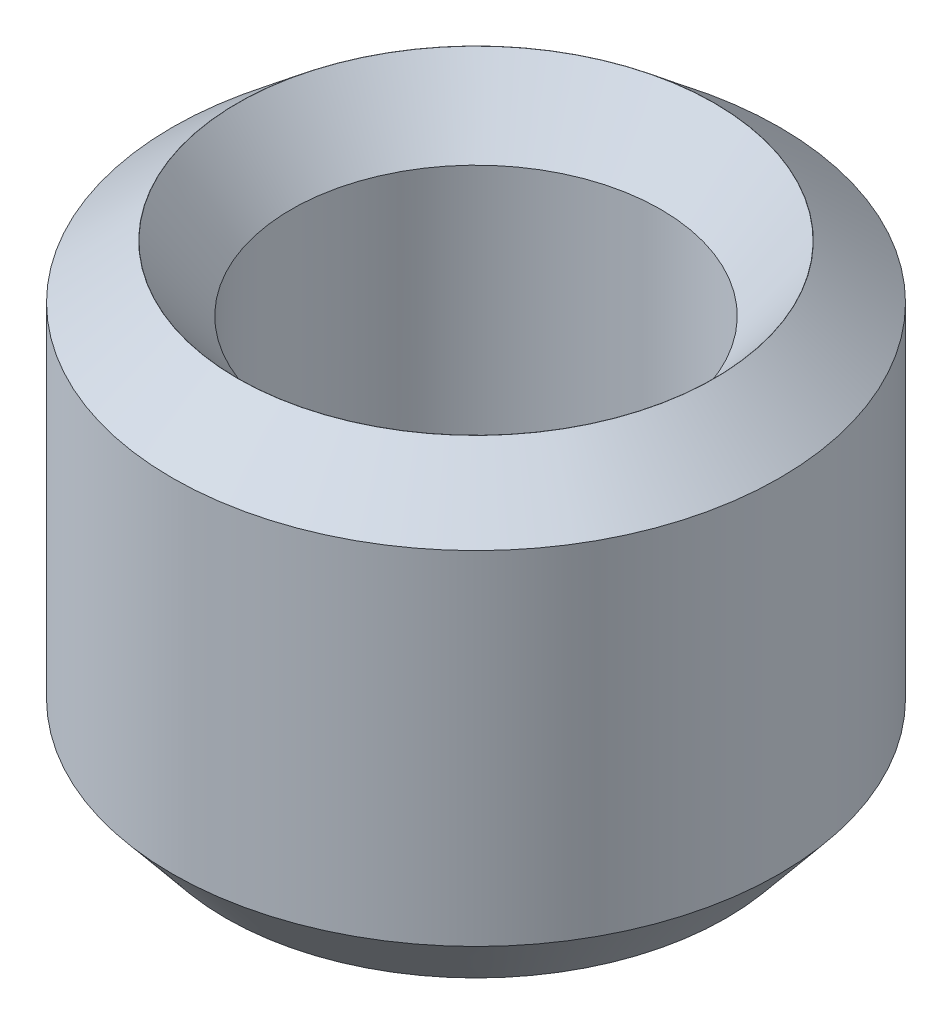
ISO-10303-21;
HEADER;
FILE_DESCRIPTION(('STEP AP214'),'2;1');
FILE_NAME('part.step','',(''),(''),'','','');
FILE_SCHEMA(('AUTOMOTIVE_DESIGN { 1 0 10303 214 1 1 1 1 }'));
ENDSEC;
DATA;
#1=APPLICATION_CONTEXT('core data for automotive mechanical design processes');
#2=APPLICATION_PROTOCOL_DEFINITION('international standard','automotive_design',2000,#1);
#3=PRODUCT_CONTEXT('',#1,'mechanical');
#4=PRODUCT('Part','Part','',(#3));
#5=PRODUCT_RELATED_PRODUCT_CATEGORY('part','',(#4));
#6=PRODUCT_DEFINITION_FORMATION('','',#4);
#7=PRODUCT_DEFINITION_CONTEXT('part definition',#1,'design');
#8=PRODUCT_DEFINITION('design','',#6,#7);
#9=PRODUCT_DEFINITION_SHAPE('','',#8);
#10=(LENGTH_UNIT() NAMED_UNIT(*) SI_UNIT(.MILLI.,.METRE.));
#11=(NAMED_UNIT(*) PLANE_ANGLE_UNIT() SI_UNIT($,.RADIAN.));
#12=(NAMED_UNIT(*) SI_UNIT($,.STERADIAN.) SOLID_ANGLE_UNIT());
#13=UNCERTAINTY_MEASURE_WITH_UNIT(LENGTH_MEASURE(1.E-05),#10,'distance_accuracy_value','');
#14=(GEOMETRIC_REPRESENTATION_CONTEXT(3) GLOBAL_UNCERTAINTY_ASSIGNED_CONTEXT((#13)) GLOBAL_UNIT_ASSIGNED_CONTEXT((#10,
#11,#12)) REPRESENTATION_CONTEXT('',''));
#15=CARTESIAN_POINT('',(0.,0.,0.));
#16=DIRECTION('',(0.,0.,1.));
#17=DIRECTION('',(1.,0.,0.));
#18=AXIS2_PLACEMENT_3D('',#15,#16,#17);
#19=CARTESIAN_POINT('',(0.,15.2008271259609,0.));
#20=DIRECTION('',(0.,-1.,0.));
#21=DIRECTION('',(0.,0.,-1.));
#22=AXIS2_PLACEMENT_3D('',#19,#20,#21);
#23=CYLINDRICAL_SURFACE('',#22,10.);
#24=CARTESIAN_POINT('',(0.,2.14671689377613,0.));
#25=DIRECTION('',(0.,1.,0.));
#26=DIRECTION('',(0.,0.,1.));
#27=AXIS2_PLACEMENT_3D('',#24,#25,#26);
#28=CIRCLE('',#27,10.);
#29=CARTESIAN_POINT('',(0.,2.14671689377613,10.));
#30=VERTEX_POINT('',#29);
#31=EDGE_CURVE('E10',#30,#30,#28,.T.);
#32=ORIENTED_EDGE('',*,*,#31,.T.);
#33=EDGE_LOOP('',(#32));
#34=FACE_BOUND('',#33,.T.);
#35=CARTESIAN_POINT('',(0.,13.435023827467,0.));
#36=DIRECTION('',(0.,1.,0.));
#37=DIRECTION('',(0.,0.,1.));
#38=AXIS2_PLACEMENT_3D('',#35,#36,#37);
#39=CIRCLE('',#38,10.);
#40=CARTESIAN_POINT('',(0.,13.435023827467,10.));
#41=VERTEX_POINT('',#40);
#42=EDGE_CURVE('E50',#41,#41,#39,.F.);
#43=ORIENTED_EDGE('',*,*,#42,.T.);
#44=EDGE_LOOP('',(#43));
#45=FACE_BOUND('',#44,.T.);
#46=ADVANCED_FACE('F39',(#34,#45),#23,.T.);
#47=CARTESIAN_POINT('',(0.,15.2008271259609,0.));
#48=DIRECTION('',(0.,1.,0.));
#49=DIRECTION('',(0.,0.,1.));
#50=AXIS2_PLACEMENT_3D('',#47,#48,#49);
#51=PLANE('',#50);
#52=CARTESIAN_POINT('',(0.,15.2008271259609,0.));
#53=DIRECTION('',(0.,1.,0.));
#54=DIRECTION('',(0.,0.,1.));
#55=AXIS2_PLACEMENT_3D('',#52,#53,#54);
#56=CIRCLE('',#55,7.84872193148168);
#57=CARTESIAN_POINT('',(0.,15.2008271259609,7.84872193148168));
#58=VERTEX_POINT('',#57);
#59=EDGE_CURVE('E58',#58,#58,#56,.F.);
#60=ORIENTED_EDGE('',*,*,#59,.T.);
#61=EDGE_LOOP('',(#60));
#62=FACE_BOUND('',#61,.T.);
#63=CARTESIAN_POINT('',(0.,15.2008271259609,0.));
#64=DIRECTION('',(0.,1.,0.));
#65=DIRECTION('',(0.,0.,1.));
#66=AXIS2_PLACEMENT_3D('',#63,#64,#65);
#67=CIRCLE('',#66,7.85328310622388);
#68=CARTESIAN_POINT('',(0.,15.2008271259609,7.85328310622388));
#69=VERTEX_POINT('',#68);
#70=EDGE_CURVE('E61',#69,#69,#67,.T.);
#71=ORIENTED_EDGE('',*,*,#70,.T.);
#72=EDGE_LOOP('',(#71));
#73=FACE_BOUND('',#72,.T.);
#74=ADVANCED_FACE('F88',(#62,#73),#51,.T.);
#75=CARTESIAN_POINT('',(0.,0.,0.));
#76=DIRECTION('',(0.,1.,0.));
#77=DIRECTION('',(0.,0.,1.));
#78=AXIS2_PLACEMENT_3D('',#75,#76,#77);
#79=PLANE('',#78);
#80=CARTESIAN_POINT('',(0.,0.,0.));
#81=DIRECTION('',(0.,1.,0.));
#82=DIRECTION('',(0.,0.,1.));
#83=AXIS2_PLACEMENT_3D('',#80,#81,#82);
#84=CIRCLE('',#83,8.22963552676389);
#85=CARTESIAN_POINT('',(0.,0.,-8.22963552676389));
#86=VERTEX_POINT('',#85);
#87=EDGE_CURVE('E51',#86,#86,#84,.T.);
#88=ORIENTED_EDGE('',*,*,#87,.T.);
#89=EDGE_LOOP('',(#88));
#90=FACE_BOUND('',#89,.T.);
#91=CARTESIAN_POINT('',(0.,0.,0.));
#92=DIRECTION('',(0.,1.,0.));
#93=DIRECTION('',(0.,0.,1.));
#94=AXIS2_PLACEMENT_3D('',#91,#92,#93);
#95=CIRCLE('',#94,8.23419670150608);
#96=CARTESIAN_POINT('',(0.,0.,8.23419670150608));
#97=VERTEX_POINT('',#96);
#98=EDGE_CURVE('E54',#97,#97,#95,.F.);
#99=ORIENTED_EDGE('',*,*,#98,.T.);
#100=EDGE_LOOP('',(#99));
#101=FACE_BOUND('',#100,.T.);
#102=ADVANCED_FACE('F83',(#90,#101),#79,.F.);
#103=CARTESIAN_POINT('',(0.,15.2008271259609,0.));
#104=DIRECTION('',(0.,-1.,0.));
#105=DIRECTION('',(0.,0.,-1.));
#106=AXIS2_PLACEMENT_3D('',#103,#104,#105);
#107=CYLINDRICAL_SURFACE('',#106,6.08291863298776);
#108=CARTESIAN_POINT('',(0.,13.0541102321848,0.));
#109=DIRECTION('',(0.,1.,0.));
#110=DIRECTION('',(0.,0.,1.));
#111=AXIS2_PLACEMENT_3D('',#108,#109,#110);
#112=CIRCLE('',#111,6.08291863298776);
#113=CARTESIAN_POINT('',(0.,13.0541102321848,6.08291863298776));
#114=VERTEX_POINT('',#113);
#115=EDGE_CURVE('E67',#114,#114,#112,.T.);
#116=ORIENTED_EDGE('',*,*,#115,.T.);
#117=EDGE_LOOP('',(#116));
#118=FACE_BOUND('',#117,.T.);
#119=CARTESIAN_POINT('',(0.,1.76580329849392,0.));
#120=DIRECTION('',(0.,1.,0.));
#121=DIRECTION('',(0.,0.,1.));
#122=AXIS2_PLACEMENT_3D('',#119,#120,#121);
#123=CIRCLE('',#122,6.08291863298776);
#124=CARTESIAN_POINT('',(0.,1.76580329849392,-6.08291863298776));
#125=VERTEX_POINT('',#124);
#126=EDGE_CURVE('E69',#125,#125,#123,.F.);
#127=ORIENTED_EDGE('',*,*,#126,.T.);
#128=EDGE_LOOP('',(#127));
#129=FACE_BOUND('',#128,.T.);
#130=ADVANCED_FACE('F71',(#118,#129),#107,.F.);
#131=CARTESIAN_POINT('',(0.,13.0541102321848,0.));
#132=DIRECTION('',(0.,1.,0.));
#133=DIRECTION('',(0.,0.,1.));
#134=AXIS2_PLACEMENT_3D('',#131,#132,#133);
#135=CONICAL_SURFACE('',#134,6.08291863298776,0.688346422290584);
#136=ORIENTED_EDGE('',*,*,#59,.F.);
#137=EDGE_LOOP('',(#136));
#138=FACE_BOUND('',#137,.T.);
#139=ORIENTED_EDGE('',*,*,#115,.F.);
#140=EDGE_LOOP('',(#139));
#141=FACE_BOUND('',#140,.T.);
#142=ADVANCED_FACE('F77',(#138,#141),#135,.F.);
#143=CARTESIAN_POINT('',(0.,0.,0.));
#144=DIRECTION('',(0.,-1.,0.));
#145=DIRECTION('',(0.,0.,-1.));
#146=AXIS2_PLACEMENT_3D('',#143,#144,#145);
#147=CONICAL_SURFACE('',#146,8.22963552676389,0.882449904504315);
#148=CARTESIAN_POINT('',(0.,1.76580329849392,-6.08291863298776));
#149=CARTESIAN_POINT('',(0.,1.74740951413461,-6.10528026729792));
#150=CARTESIAN_POINT('',(0.,1.7290157297753,-6.12764190160809));
#151=CARTESIAN_POINT('',(0.,1.69222816105668,-6.17236517022843));
#152=CARTESIAN_POINT('',(0.,1.67383437669737,-6.1947268045386));
#153=CARTESIAN_POINT('',(0.,1.63704680797874,-6.23945007315893));
#154=CARTESIAN_POINT('',(0.,1.61865302361943,-6.2618117074691));
#155=CARTESIAN_POINT('',(0.,1.58186545490081,-6.30653497608944));
#156=CARTESIAN_POINT('',(0.,1.56347167054149,-6.3288966103996));
#157=CARTESIAN_POINT('',(0.,1.52668410182287,-6.37361987901994));
#158=CARTESIAN_POINT('',(0.,1.50829031746356,-6.39598151333011));
#159=CARTESIAN_POINT('',(0.,1.47150274874494,-6.44070478195045));
#160=CARTESIAN_POINT('',(0.,1.45310896438562,-6.46306641626061));
#161=CARTESIAN_POINT('',(0.,1.416321395667,-6.50778968488095));
#162=CARTESIAN_POINT('',(0.,1.39792761130769,-6.53015131919112));
#163=CARTESIAN_POINT('',(0.,1.36114004258907,-6.57487458781145));
#164=CARTESIAN_POINT('',(0.,1.34274625822975,-6.59723622212162));
#165=CARTESIAN_POINT('',(0.,1.30595868951113,-6.64195949074196));
#166=CARTESIAN_POINT('',(0.,1.28756490515182,-6.66432112505213));
#167=CARTESIAN_POINT('',(0.,1.2507773364332,-6.70904439367246));
#168=CARTESIAN_POINT('',(0.,1.23238355207388,-6.73140602798263));
#169=CARTESIAN_POINT('',(0.,1.19559598335526,-6.77612929660297));
#170=CARTESIAN_POINT('',(0.,1.17720219899595,-6.79849093091313));
#171=CARTESIAN_POINT('',(0.,1.14041463027733,-6.84321419953347));
#172=CARTESIAN_POINT('',(0.,1.12202084591801,-6.86557583384364));
#173=CARTESIAN_POINT('',(0.,1.08523327719939,-6.91029910246397));
#174=CARTESIAN_POINT('',(0.,1.06683949284008,-6.93266073677414));
#175=CARTESIAN_POINT('',(0.,1.03005192412146,-6.97738400539448));
#176=CARTESIAN_POINT('',(0.,1.01165813976214,-6.99974563970465));
#177=CARTESIAN_POINT('',(0.,0.97487057104352,-7.04446890832498));
#178=CARTESIAN_POINT('',(0.,0.956476786684209,-7.06683054263515));
#179=CARTESIAN_POINT('',(0.,0.919689217965585,-7.11155381125549));
#180=CARTESIAN_POINT('',(0.,0.901295433606274,-7.13391544556566));
#181=CARTESIAN_POINT('',(0.,0.86450786488765,-7.17863871418599));
#182=CARTESIAN_POINT('',(0.,0.846114080528338,-7.20100034849616));
#183=CARTESIAN_POINT('',(0.,0.809326511809715,-7.2457236171165));
#184=CARTESIAN_POINT('',(0.,0.790932727450403,-7.26808525142666));
#185=CARTESIAN_POINT('',(0.,0.75414515873178,-7.312808520047));
#186=CARTESIAN_POINT('',(0.,0.735751374372468,-7.33517015435717));
#187=CARTESIAN_POINT('',(0.,0.698963805653845,-7.3798934229775));
#188=CARTESIAN_POINT('',(0.,0.680570021294533,-7.40225505728767));
#189=CARTESIAN_POINT('',(0.,0.64378245257591,-7.44697832590801));
#190=CARTESIAN_POINT('',(0.,0.625388668216598,-7.46933996021818));
#191=CARTESIAN_POINT('',(0.,0.588601099497975,-7.51406322883851));
#192=CARTESIAN_POINT('',(0.,0.570207315138663,-7.53642486314868));
#193=CARTESIAN_POINT('',(0.,0.533419746420039,-7.58114813176902));
#194=CARTESIAN_POINT('',(0.,0.515025962060728,-7.60350976607919));
#195=CARTESIAN_POINT('',(0.,0.478238393342104,-7.64823303469952));
#196=CARTESIAN_POINT('',(0.,0.459844608982793,-7.67059466900969));
#197=CARTESIAN_POINT('',(0.,0.423057040264169,-7.71531793763003));
#198=CARTESIAN_POINT('',(0.,0.404663255904858,-7.73767957194019));
#199=CARTESIAN_POINT('',(0.,0.367875687186234,-7.78240284056053));
#200=CARTESIAN_POINT('',(0.,0.349481902826922,-7.8047644748707));
#201=CARTESIAN_POINT('',(0.,0.312694334108299,-7.84948774349103));
#202=CARTESIAN_POINT('',(0.,0.294300549748987,-7.8718493778012));
#203=CARTESIAN_POINT('',(0.,0.257512981030364,-7.91657264642154));
#204=CARTESIAN_POINT('',(0.,0.239119196671052,-7.93893428073171));
#205=CARTESIAN_POINT('',(0.,0.202331627952429,-7.98365754935204));
#206=CARTESIAN_POINT('',(0.,0.183937843593117,-8.00601918366221));
#207=CARTESIAN_POINT('',(0.,0.147150274874494,-8.05074245228255));
#208=CARTESIAN_POINT('',(0.,0.128756490515182,-8.07310408659271));
#209=CARTESIAN_POINT('',(0.,0.0919689217965587,-8.11782735521305));
#210=CARTESIAN_POINT('',(0.,0.0735751374372468,-8.14018898952322));
#211=CARTESIAN_POINT('',(0.,0.036787568718623,-8.18491225814356));
#212=CARTESIAN_POINT('',(0.,0.0183937843593112,-8.20727389245372));
#213=CARTESIAN_POINT('',(0.,0.,-8.22963552676389));
#214=B_SPLINE_CURVE_WITH_KNOTS('',3,(#148,#149,#150,#151,#152,#153,#154,#155,#156,#157,#158,
#159,#160,#161,#162,#163,#164,#165,#166,#167,#168,#169,#170,#171,#172,#173,#174,#175,#176,#177,
#178,#179,#180,#181,#182,#183,#184,#185,#186,#187,#188,#189,#190,#191,#192,#193,#194,#195,#196,
#197,#198,#199,#200,#201,#202,#203,#204,#205,#206,#207,#208,#209,#210,#211,#212,#213),
.UNSPECIFIED.,.F.,.F.,(4,2,2,2,2,2,2,2,2,2,2,2,2,2,2,2,2,2,2,2,2,2,2,2,2,2,2,2,2,2,2,2,4),(0.,
0.0868640658080594,0.173728131616119,0.260592197424179,0.347456263232239,0.434320329040298,
0.521184394848358,0.608048460656418,0.694912526464477,0.781776592272537,0.868640658080596,
0.955504723888656,1.04236878969672,1.12923285550478,1.21609692131284,1.30296098712089,
1.38982505292895,1.47668911873701,1.56355318454507,1.65041725035313,1.73728131616119,
1.82414538196925,1.91100944777731,1.99787351358537,2.08473757939343,2.17160164520149,
2.25846571100955,2.34532977681761,2.43219384262567,2.51905790843373,2.60592197424179,
2.69278604004985,2.77965010585791),.UNSPECIFIED.);
#215=EDGE_CURVE('BSEAM73',#125,#86,#214,.T.);
#216=ORIENTED_EDGE('',*,*,#126,.F.);
#217=ORIENTED_EDGE('',*,*,#87,.F.);
#218=ORIENTED_EDGE('',*,*,#215,.T.);
#219=ORIENTED_EDGE('',*,*,#215,.F.);
#220=EDGE_LOOP('',(#216,#218,#217,#219));
#221=FACE_BOUND('',#220,.T.);
#222=ADVANCED_FACE('F73',(#221),#147,.F.);
#223=CARTESIAN_POINT('',(0.,2.14671689377613,0.));
#224=DIRECTION('',(0.,1.,0.));
#225=DIRECTION('',(0.,0.,1.));
#226=AXIS2_PLACEMENT_3D('',#223,#224,#225);
#227=CONICAL_SURFACE('',#226,10.,0.688346422290583);
#228=ORIENTED_EDGE('',*,*,#98,.F.);
#229=EDGE_LOOP('',(#228));
#230=FACE_BOUND('',#229,.T.);
#231=ORIENTED_EDGE('',*,*,#31,.F.);
#232=EDGE_LOOP('',(#231));
#233=FACE_BOUND('',#232,.T.);
#234=ADVANCED_FACE('F76',(#230,#233),#227,.T.);
#235=CARTESIAN_POINT('',(0.,15.2008271259609,0.));
#236=DIRECTION('',(0.,-1.,0.));
#237=DIRECTION('',(0.,0.,-1.));
#238=AXIS2_PLACEMENT_3D('',#235,#236,#237);
#239=CONICAL_SURFACE('',#238,7.85328310622388,0.882449904504313);
#240=ORIENTED_EDGE('',*,*,#42,.F.);
#241=EDGE_LOOP('',(#240));
#242=FACE_BOUND('',#241,.T.);
#243=ORIENTED_EDGE('',*,*,#70,.F.);
#244=EDGE_LOOP('',(#243));
#245=FACE_BOUND('',#244,.T.);
#246=ADVANCED_FACE('F45',(#242,#245),#239,.T.);
#247=CLOSED_SHELL('',(#46,#74,#102,#130,#142,#222,#234,#246));
#248=MANIFOLD_SOLID_BREP('B2',#247);
#249=ADVANCED_BREP_SHAPE_REPRESENTATION('',(#18,#248),#14);
#250=SHAPE_DEFINITION_REPRESENTATION(#9,#249);
ENDSEC;
END-ISO-10303-21;
